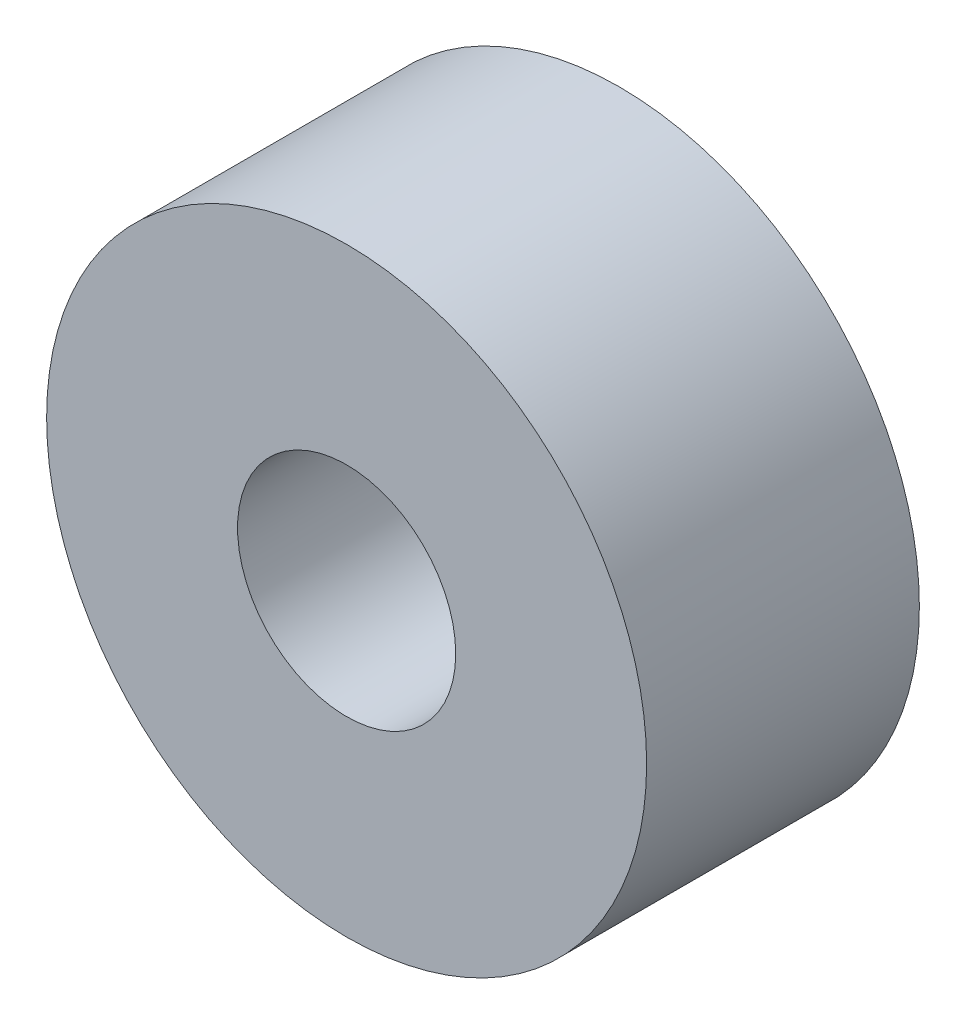
ISO-10303-21;
HEADER;
FILE_DESCRIPTION(('STEP AP214'),'2;1');
FILE_NAME('part.step','',(''),(''),'','','');
FILE_SCHEMA(('AUTOMOTIVE_DESIGN { 1 0 10303 214 1 1 1 1 }'));
ENDSEC;
DATA;
#1=APPLICATION_CONTEXT('core data for automotive mechanical design processes');
#2=APPLICATION_PROTOCOL_DEFINITION('international standard','automotive_design',2000,#1);
#3=PRODUCT_CONTEXT('',#1,'mechanical');
#4=PRODUCT('Part','Part','',(#3));
#5=PRODUCT_RELATED_PRODUCT_CATEGORY('part','',(#4));
#6=PRODUCT_DEFINITION_FORMATION('','',#4);
#7=PRODUCT_DEFINITION_CONTEXT('part definition',#1,'design');
#8=PRODUCT_DEFINITION('design','',#6,#7);
#9=PRODUCT_DEFINITION_SHAPE('','',#8);
#10=(LENGTH_UNIT() NAMED_UNIT(*) SI_UNIT(.MILLI.,.METRE.));
#11=(NAMED_UNIT(*) PLANE_ANGLE_UNIT() SI_UNIT($,.RADIAN.));
#12=(NAMED_UNIT(*) SI_UNIT($,.STERADIAN.) SOLID_ANGLE_UNIT());
#13=UNCERTAINTY_MEASURE_WITH_UNIT(LENGTH_MEASURE(1.E-05),#10,'distance_accuracy_value','');
#14=(GEOMETRIC_REPRESENTATION_CONTEXT(3) GLOBAL_UNCERTAINTY_ASSIGNED_CONTEXT((#13)) GLOBAL_UNIT_ASSIGNED_CONTEXT((#10,
#11,#12)) REPRESENTATION_CONTEXT('',''));
#15=CARTESIAN_POINT('',(0.,0.,0.));
#16=DIRECTION('',(0.,0.,1.));
#17=DIRECTION('',(1.,0.,0.));
#18=AXIS2_PLACEMENT_3D('',#15,#16,#17);
#19=CARTESIAN_POINT('',(0.,0.,10.));
#20=DIRECTION('',(0.,0.,1.));
#21=DIRECTION('',(1.,0.,0.));
#22=AXIS2_PLACEMENT_3D('',#19,#20,#21);
#23=PLANE('',#22);
#24=CARTESIAN_POINT('',(0.,0.,10.));
#25=DIRECTION('',(0.,0.,1.));
#26=DIRECTION('',(1.,0.,0.));
#27=AXIS2_PLACEMENT_3D('',#24,#25,#26);
#28=CIRCLE('',#27,11.);
#29=CARTESIAN_POINT('',(11.,0.,10.));
#30=VERTEX_POINT('',#29);
#31=EDGE_CURVE('E10',#30,#30,#28,.T.);
#32=ORIENTED_EDGE('',*,*,#31,.T.);
#33=EDGE_LOOP('',(#32));
#34=FACE_BOUND('',#33,.T.);
#35=CARTESIAN_POINT('',(0.,0.,10.));
#36=DIRECTION('',(0.,0.,1.));
#37=DIRECTION('',(1.,0.,0.));
#38=AXIS2_PLACEMENT_3D('',#35,#36,#37);
#39=CIRCLE('',#38,4.);
#40=CARTESIAN_POINT('',(4.,0.,10.));
#41=VERTEX_POINT('',#40);
#42=EDGE_CURVE('E42',#41,#41,#39,.T.);
#43=ORIENTED_EDGE('',*,*,#42,.F.);
#44=EDGE_LOOP('',(#43));
#45=FACE_BOUND('',#44,.T.);
#46=ADVANCED_FACE('F31',(#34,#45),#23,.T.);
#47=CARTESIAN_POINT('',(0.,0.,0.));
#48=DIRECTION('',(0.,0.,1.));
#49=DIRECTION('',(1.,0.,0.));
#50=AXIS2_PLACEMENT_3D('',#47,#48,#49);
#51=PLANE('',#50);
#52=CARTESIAN_POINT('',(0.,0.,0.));
#53=DIRECTION('',(0.,0.,1.));
#54=DIRECTION('',(1.,0.,0.));
#55=AXIS2_PLACEMENT_3D('',#52,#53,#54);
#56=CIRCLE('',#55,11.);
#57=CARTESIAN_POINT('',(11.,0.,0.));
#58=VERTEX_POINT('',#57);
#59=EDGE_CURVE('E35',#58,#58,#56,.T.);
#60=ORIENTED_EDGE('',*,*,#59,.F.);
#61=EDGE_LOOP('',(#60));
#62=FACE_BOUND('',#61,.T.);
#63=CARTESIAN_POINT('',(0.,0.,0.));
#64=DIRECTION('',(0.,0.,1.));
#65=DIRECTION('',(1.,0.,0.));
#66=AXIS2_PLACEMENT_3D('',#63,#64,#65);
#67=CIRCLE('',#66,4.);
#68=CARTESIAN_POINT('',(4.,0.,0.));
#69=VERTEX_POINT('',#68);
#70=EDGE_CURVE('E44',#69,#69,#67,.T.);
#71=ORIENTED_EDGE('',*,*,#70,.T.);
#72=EDGE_LOOP('',(#71));
#73=FACE_BOUND('',#72,.T.);
#74=ADVANCED_FACE('F54',(#62,#73),#51,.F.);
#75=CARTESIAN_POINT('',(0.,0.,10.));
#76=DIRECTION('',(0.,0.,-1.));
#77=DIRECTION('',(-1.,0.,0.));
#78=AXIS2_PLACEMENT_3D('',#75,#76,#77);
#79=CYLINDRICAL_SURFACE('',#78,11.);
#80=ORIENTED_EDGE('',*,*,#31,.F.);
#81=EDGE_LOOP('',(#80));
#82=FACE_BOUND('',#81,.T.);
#83=ORIENTED_EDGE('',*,*,#59,.T.);
#84=EDGE_LOOP('',(#83));
#85=FACE_BOUND('',#84,.T.);
#86=ADVANCED_FACE('F33',(#82,#85),#79,.T.);
#87=CARTESIAN_POINT('',(0.,0.,10.));
#88=DIRECTION('',(0.,0.,-1.));
#89=DIRECTION('',(-1.,0.,0.));
#90=AXIS2_PLACEMENT_3D('',#87,#88,#89);
#91=CYLINDRICAL_SURFACE('',#90,4.);
#92=ORIENTED_EDGE('',*,*,#42,.T.);
#93=EDGE_LOOP('',(#92));
#94=FACE_BOUND('',#93,.T.);
#95=ORIENTED_EDGE('',*,*,#70,.F.);
#96=EDGE_LOOP('',(#95));
#97=FACE_BOUND('',#96,.T.);
#98=ADVANCED_FACE('F50',(#94,#97),#91,.F.);
#99=CLOSED_SHELL('',(#46,#74,#86,#98));
#100=MANIFOLD_SOLID_BREP('B2',#99);
#101=ADVANCED_BREP_SHAPE_REPRESENTATION('',(#18,#100),#14);
#102=SHAPE_DEFINITION_REPRESENTATION(#9,#101);
ENDSEC;
END-ISO-10303-21;
